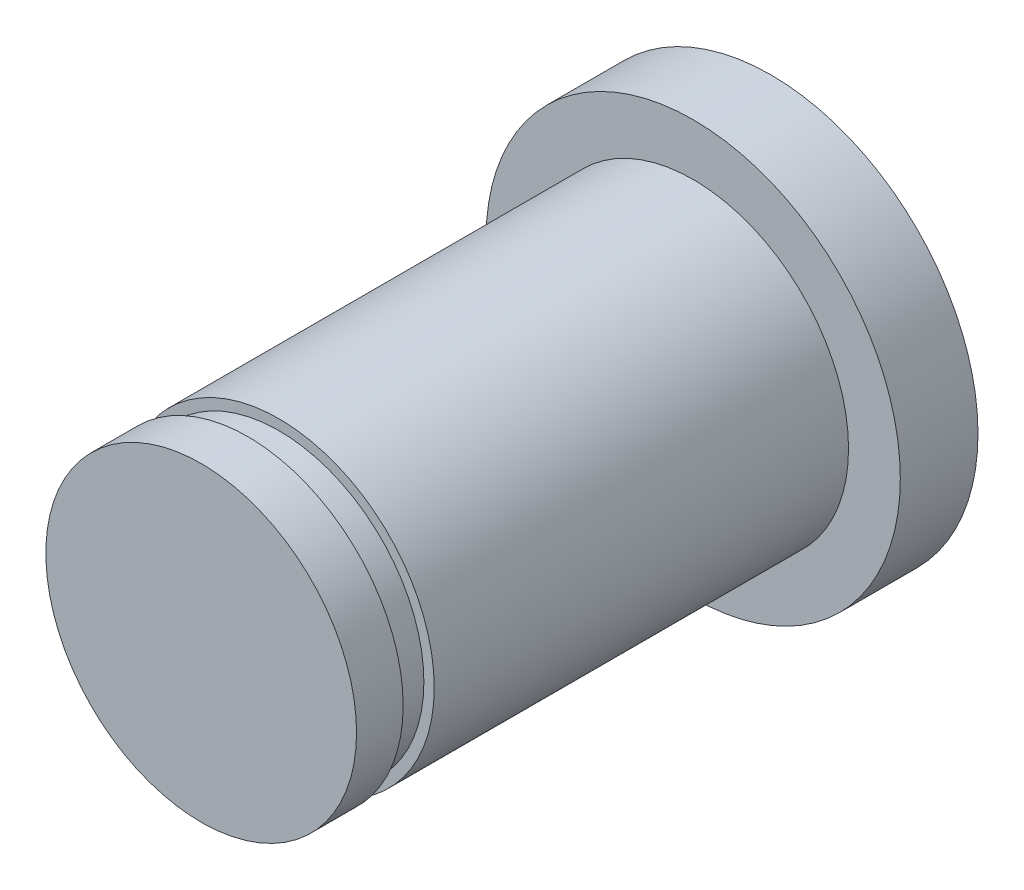
ISO-10303-21;
HEADER;
FILE_DESCRIPTION(('STEP AP214'),'2;1');
FILE_NAME('part.step','',(''),(''),'','','');
FILE_SCHEMA(('AUTOMOTIVE_DESIGN { 1 0 10303 214 1 1 1 1 }'));
ENDSEC;
DATA;
#1=APPLICATION_CONTEXT('core data for automotive mechanical design processes');
#2=APPLICATION_PROTOCOL_DEFINITION('international standard','automotive_design',2000,#1);
#3=PRODUCT_CONTEXT('',#1,'mechanical');
#4=PRODUCT('Part','Part','',(#3));
#5=PRODUCT_RELATED_PRODUCT_CATEGORY('part','',(#4));
#6=PRODUCT_DEFINITION_FORMATION('','',#4);
#7=PRODUCT_DEFINITION_CONTEXT('part definition',#1,'design');
#8=PRODUCT_DEFINITION('design','',#6,#7);
#9=PRODUCT_DEFINITION_SHAPE('','',#8);
#10=(LENGTH_UNIT() NAMED_UNIT(*) SI_UNIT(.MILLI.,.METRE.));
#11=(NAMED_UNIT(*) PLANE_ANGLE_UNIT() SI_UNIT($,.RADIAN.));
#12=(NAMED_UNIT(*) SI_UNIT($,.STERADIAN.) SOLID_ANGLE_UNIT());
#13=UNCERTAINTY_MEASURE_WITH_UNIT(LENGTH_MEASURE(1.E-05),#10,'distance_accuracy_value','');
#14=(GEOMETRIC_REPRESENTATION_CONTEXT(3) GLOBAL_UNCERTAINTY_ASSIGNED_CONTEXT((#13)) GLOBAL_UNIT_ASSIGNED_CONTEXT((#10,
#11,#12)) REPRESENTATION_CONTEXT('',''));
#15=CARTESIAN_POINT('',(0.,0.,0.));
#16=DIRECTION('',(0.,0.,1.));
#17=DIRECTION('',(1.,0.,0.));
#18=AXIS2_PLACEMENT_3D('',#15,#16,#17);
#19=CARTESIAN_POINT('',(0.365715483103546,0.182857741551773,11.));
#20=DIRECTION('',(0.,0.,-1.));
#21=DIRECTION('',(-1.,0.,0.));
#22=AXIS2_PLACEMENT_3D('',#19,#20,#21);
#23=CYLINDRICAL_SURFACE('',#22,3.);
#24=CARTESIAN_POINT('',(0.365715483103546,0.182857741551773,1.5));
#25=DIRECTION('',(0.,0.,1.));
#26=DIRECTION('',(1.,0.,0.));
#27=AXIS2_PLACEMENT_3D('',#24,#25,#26);
#28=CIRCLE('',#27,3.);
#29=CARTESIAN_POINT('',(3.36571548310355,0.182857741551773,1.5));
#30=VERTEX_POINT('',#29);
#31=EDGE_CURVE('E67',#30,#30,#28,.F.);
#32=ORIENTED_EDGE('',*,*,#31,.F.);
#33=EDGE_LOOP('',(#32));
#34=FACE_BOUND('',#33,.T.);
#35=CARTESIAN_POINT('',(0.365715483103546,0.182857741551773,9.5));
#36=DIRECTION('',(0.,0.,1.));
#37=DIRECTION('',(1.,0.,0.));
#38=AXIS2_PLACEMENT_3D('',#35,#36,#37);
#39=CIRCLE('',#38,3.);
#40=CARTESIAN_POINT('',(3.36571548310355,0.182857741551773,9.5));
#41=VERTEX_POINT('',#40);
#42=EDGE_CURVE('E54',#41,#41,#39,.T.);
#43=ORIENTED_EDGE('',*,*,#42,.F.);
#44=EDGE_LOOP('',(#43));
#45=FACE_BOUND('',#44,.T.);
#46=ADVANCED_FACE('F50',(#34,#45),#23,.T.);
#47=CARTESIAN_POINT('',(0.365715483103546,0.182857741551773,1.5));
#48=DIRECTION('',(0.,0.,-1.));
#49=DIRECTION('',(-1.,0.,0.));
#50=AXIS2_PLACEMENT_3D('',#47,#48,#49);
#51=CYLINDRICAL_SURFACE('',#50,4.);
#52=CARTESIAN_POINT('',(0.365715483103546,0.182857741551773,1.5));
#53=DIRECTION('',(0.,0.,1.));
#54=DIRECTION('',(1.,0.,0.));
#55=AXIS2_PLACEMENT_3D('',#52,#53,#54);
#56=CIRCLE('',#55,4.);
#57=CARTESIAN_POINT('',(4.36571548310355,0.182857741551773,1.5));
#58=VERTEX_POINT('',#57);
#59=EDGE_CURVE('E12',#58,#58,#56,.T.);
#60=ORIENTED_EDGE('',*,*,#59,.F.);
#61=EDGE_LOOP('',(#60));
#62=FACE_BOUND('',#61,.T.);
#63=CARTESIAN_POINT('',(0.365715483103546,0.182857741551773,0.));
#64=DIRECTION('',(0.,0.,1.));
#65=DIRECTION('',(1.,0.,0.));
#66=AXIS2_PLACEMENT_3D('',#63,#64,#65);
#67=CIRCLE('',#66,4.);
#68=CARTESIAN_POINT('',(4.36571548310355,0.182857741551773,0.));
#69=VERTEX_POINT('',#68);
#70=EDGE_CURVE('E59',#69,#69,#67,.T.);
#71=ORIENTED_EDGE('',*,*,#70,.T.);
#72=EDGE_LOOP('',(#71));
#73=FACE_BOUND('',#72,.T.);
#74=ADVANCED_FACE('F52',(#62,#73),#51,.T.);
#75=CARTESIAN_POINT('',(0.365715483103546,0.182857741551773,1.5));
#76=DIRECTION('',(0.,0.,1.));
#77=DIRECTION('',(1.,0.,0.));
#78=AXIS2_PLACEMENT_3D('',#75,#76,#77);
#79=PLANE('',#78);
#80=ORIENTED_EDGE('',*,*,#31,.T.);
#81=EDGE_LOOP('',(#80));
#82=FACE_BOUND('',#81,.T.);
#83=ORIENTED_EDGE('',*,*,#59,.T.);
#84=EDGE_LOOP('',(#83));
#85=FACE_BOUND('',#84,.T.);
#86=ADVANCED_FACE('F101',(#82,#85),#79,.T.);
#87=CARTESIAN_POINT('',(0.365715483103546,0.182857741551773,0.));
#88=DIRECTION('',(0.,0.,1.));
#89=DIRECTION('',(1.,0.,0.));
#90=AXIS2_PLACEMENT_3D('',#87,#88,#89);
#91=PLANE('',#90);
#92=ORIENTED_EDGE('',*,*,#70,.F.);
#93=EDGE_LOOP('',(#92));
#94=FACE_BOUND('',#93,.T.);
#95=ADVANCED_FACE('F112',(#94),#91,.F.);
#96=CARTESIAN_POINT('',(0.365715483103546,0.182857741551773,9.5));
#97=DIRECTION('',(0.,0.,1.));
#98=DIRECTION('',(1.,0.,0.));
#99=AXIS2_PLACEMENT_3D('',#96,#97,#98);
#100=PLANE('',#99);
#101=CARTESIAN_POINT('',(0.365715483103546,0.182857741551773,9.5));
#102=DIRECTION('',(0.,0.,1.));
#103=DIRECTION('',(1.,0.,0.));
#104=AXIS2_PLACEMENT_3D('',#101,#102,#103);
#105=CIRCLE('',#104,2.8);
#106=CARTESIAN_POINT('',(3.16571548310355,0.182857741551773,9.5));
#107=VERTEX_POINT('',#106);
#108=EDGE_CURVE('E74',#107,#107,#105,.T.);
#109=ORIENTED_EDGE('',*,*,#108,.F.);
#110=EDGE_LOOP('',(#109));
#111=FACE_BOUND('',#110,.T.);
#112=ORIENTED_EDGE('',*,*,#42,.T.);
#113=EDGE_LOOP('',(#112));
#114=FACE_BOUND('',#113,.T.);
#115=ADVANCED_FACE('F109',(#111,#114),#100,.T.);
#116=CARTESIAN_POINT('',(0.365715483103546,0.182857741551773,10.1));
#117=DIRECTION('',(0.,0.,1.));
#118=DIRECTION('',(1.,0.,0.));
#119=AXIS2_PLACEMENT_3D('',#116,#117,#118);
#120=PLANE('',#119);
#121=CARTESIAN_POINT('',(0.365715483103546,0.182857741551773,10.1));
#122=DIRECTION('',(0.,0.,1.));
#123=DIRECTION('',(1.,0.,0.));
#124=AXIS2_PLACEMENT_3D('',#121,#122,#123);
#125=CIRCLE('',#124,2.8);
#126=CARTESIAN_POINT('',(3.16571548310355,0.182857741551773,10.1));
#127=VERTEX_POINT('',#126);
#128=EDGE_CURVE('E83',#127,#127,#125,.T.);
#129=ORIENTED_EDGE('',*,*,#128,.T.);
#130=EDGE_LOOP('',(#129));
#131=FACE_BOUND('',#130,.T.);
#132=CARTESIAN_POINT('',(0.365715483103546,0.182857741551773,10.1));
#133=DIRECTION('',(0.,0.,1.));
#134=DIRECTION('',(1.,0.,0.));
#135=AXIS2_PLACEMENT_3D('',#132,#133,#134);
#136=CIRCLE('',#135,3.);
#137=CARTESIAN_POINT('',(3.36571548310355,0.182857741551773,10.1));
#138=VERTEX_POINT('',#137);
#139=EDGE_CURVE('E71',#138,#138,#136,.T.);
#140=ORIENTED_EDGE('',*,*,#139,.F.);
#141=EDGE_LOOP('',(#140));
#142=FACE_BOUND('',#141,.T.);
#143=ADVANCED_FACE('F111',(#131,#142),#120,.F.);
#144=CARTESIAN_POINT('',(0.365715483103546,0.182857741551773,9.5));
#145=DIRECTION('',(0.,0.,1.));
#146=DIRECTION('',(1.,0.,0.));
#147=AXIS2_PLACEMENT_3D('',#144,#145,#146);
#148=CYLINDRICAL_SURFACE('',#147,2.8);
#149=ORIENTED_EDGE('',*,*,#108,.T.);
#150=EDGE_LOOP('',(#149));
#151=FACE_BOUND('',#150,.T.);
#152=ORIENTED_EDGE('',*,*,#128,.F.);
#153=EDGE_LOOP('',(#152));
#154=FACE_BOUND('',#153,.T.);
#155=ADVANCED_FACE('F118',(#151,#154),#148,.T.);
#156=CARTESIAN_POINT('',(0.365715483103546,0.182857741551773,11.));
#157=DIRECTION('',(0.,0.,1.));
#158=DIRECTION('',(1.,0.,0.));
#159=AXIS2_PLACEMENT_3D('',#156,#157,#158);
#160=PLANE('',#159);
#161=CARTESIAN_POINT('',(0.365715483103546,0.182857741551773,11.));
#162=DIRECTION('',(0.,0.,1.));
#163=DIRECTION('',(1.,0.,0.));
#164=AXIS2_PLACEMENT_3D('',#161,#162,#163);
#165=CIRCLE('',#164,3.);
#166=CARTESIAN_POINT('',(3.36571548310355,0.182857741551773,11.));
#167=VERTEX_POINT('',#166);
#168=EDGE_CURVE('E81',#167,#167,#165,.T.);
#169=ORIENTED_EDGE('',*,*,#168,.T.);
#170=EDGE_LOOP('',(#169));
#171=FACE_BOUND('',#170,.T.);
#172=ADVANCED_FACE('F124',(#171),#160,.T.);
#173=ORIENTED_EDGE('',*,*,#139,.T.);
#174=EDGE_LOOP('',(#173));
#175=FACE_BOUND('',#174,.T.);
#176=ORIENTED_EDGE('',*,*,#168,.F.);
#177=EDGE_LOOP('',(#176));
#178=FACE_BOUND('',#177,.T.);
#179=ADVANCED_FACE('F106',(#175,#178),#23,.T.);
#180=CLOSED_SHELL('',(#46,#74,#86,#95,#115,#143,#155,#172,#179));
#181=MANIFOLD_SOLID_BREP('B2',#180);
#182=ADVANCED_BREP_SHAPE_REPRESENTATION('',(#18,#181),#14);
#183=SHAPE_DEFINITION_REPRESENTATION(#9,#182);
ENDSEC;
END-ISO-10303-21;
